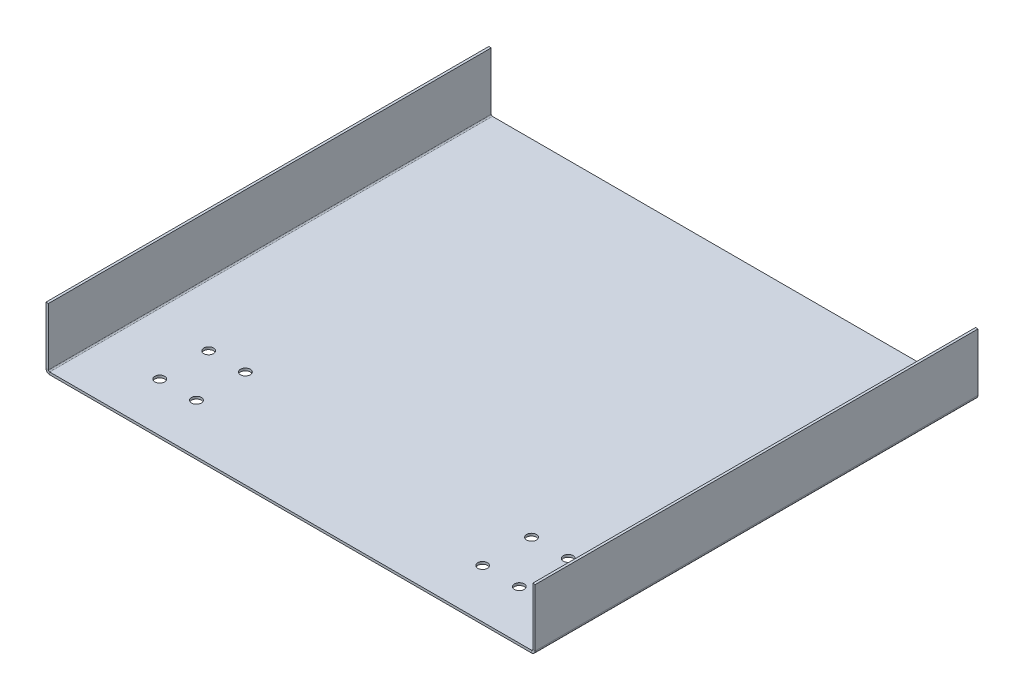
ISO-10303-21;
HEADER;
FILE_DESCRIPTION(('STEP AP214'),'2;1');
FILE_NAME('part.step','',(''),(''),'','','');
FILE_SCHEMA(('AUTOMOTIVE_DESIGN { 1 0 10303 214 1 1 1 1 }'));
ENDSEC;
DATA;
#1=APPLICATION_CONTEXT('core data for automotive mechanical design processes');
#2=APPLICATION_PROTOCOL_DEFINITION('international standard','automotive_design',2000,#1);
#3=PRODUCT_CONTEXT('',#1,'mechanical');
#4=PRODUCT('Part','Part','',(#3));
#5=PRODUCT_RELATED_PRODUCT_CATEGORY('part','',(#4));
#6=PRODUCT_DEFINITION_FORMATION('','',#4);
#7=PRODUCT_DEFINITION_CONTEXT('part definition',#1,'design');
#8=PRODUCT_DEFINITION('design','',#6,#7);
#9=PRODUCT_DEFINITION_SHAPE('','',#8);
#10=(LENGTH_UNIT() NAMED_UNIT(*) SI_UNIT(.MILLI.,.METRE.));
#11=(NAMED_UNIT(*) PLANE_ANGLE_UNIT() SI_UNIT($,.RADIAN.));
#12=(NAMED_UNIT(*) SI_UNIT($,.STERADIAN.) SOLID_ANGLE_UNIT());
#13=UNCERTAINTY_MEASURE_WITH_UNIT(LENGTH_MEASURE(1.E-05),#10,'distance_accuracy_value','');
#14=(GEOMETRIC_REPRESENTATION_CONTEXT(3) GLOBAL_UNCERTAINTY_ASSIGNED_CONTEXT((#13)) GLOBAL_UNIT_ASSIGNED_CONTEXT((#10,
#11,#12)) REPRESENTATION_CONTEXT('',''));
#15=CARTESIAN_POINT('',(0.,0.,0.));
#16=DIRECTION('',(0.,0.,1.));
#17=DIRECTION('',(1.,0.,0.));
#18=AXIS2_PLACEMENT_3D('',#15,#16,#17);
#19=CARTESIAN_POINT('',(0.,3.,362.));
#20=DIRECTION('',(0.,0.,1.));
#21=DIRECTION('',(1.,0.,0.));
#22=AXIS2_PLACEMENT_3D('',#19,#20,#21);
#23=PLANE('',#22);
#24=DIRECTION('',(1.,0.,0.));
#25=VECTOR('',#24,1.);
#26=CARTESIAN_POINT('',(0.,3.,362.));
#27=LINE('',#26,#25);
#28=CARTESIAN_POINT('',(0.,3.,362.));
#29=VERTEX_POINT('',#28);
#30=CARTESIAN_POINT('',(2.,3.,362.));
#31=VERTEX_POINT('',#30);
#32=EDGE_CURVE('E11',#29,#31,#27,.T.);
#33=ORIENTED_EDGE('',*,*,#32,.F.);
#34=CARTESIAN_POINT('',(3.,3.,362.));
#35=DIRECTION('',(0.,0.,-1.));
#36=DIRECTION('',(-1.,0.,0.));
#37=AXIS2_PLACEMENT_3D('',#34,#35,#36);
#38=CIRCLE('',#37,3.);
#39=CARTESIAN_POINT('',(3.,0.,362.));
#40=VERTEX_POINT('',#39);
#41=EDGE_CURVE('E294',#40,#29,#38,.T.);
#42=ORIENTED_EDGE('',*,*,#41,.F.);
#43=DIRECTION('',(0.,-1.,0.));
#44=VECTOR('',#43,1.);
#45=CARTESIAN_POINT('',(3.,2.,362.));
#46=LINE('',#45,#44);
#47=CARTESIAN_POINT('',(3.,2.,362.));
#48=VERTEX_POINT('',#47);
#49=EDGE_CURVE('E46',#48,#40,#46,.T.);
#50=ORIENTED_EDGE('',*,*,#49,.F.);
#51=CARTESIAN_POINT('',(3.,3.,362.));
#52=DIRECTION('',(0.,0.,1.));
#53=DIRECTION('',(1.,0.,0.));
#54=AXIS2_PLACEMENT_3D('',#51,#52,#53);
#55=CIRCLE('',#54,1.);
#56=EDGE_CURVE('E171',#48,#31,#55,.F.);
#57=ORIENTED_EDGE('',*,*,#56,.T.);
#58=EDGE_LOOP('',(#33,#42,#50,#57));
#59=FACE_BOUND('',#58,.T.);
#60=ADVANCED_FACE('F37',(#59),#23,.T.);
#61=CARTESIAN_POINT('',(3.,2.,362.));
#62=DIRECTION('',(0.,0.,1.));
#63=DIRECTION('',(1.,0.,0.));
#64=AXIS2_PLACEMENT_3D('',#61,#62,#63);
#65=PLANE('',#64);
#66=DIRECTION('',(0.,1.,0.));
#67=VECTOR('',#66,1.);
#68=CARTESIAN_POINT('',(0.,0.,362.));
#69=LINE('',#68,#67);
#70=CARTESIAN_POINT('',(0.,50.,362.));
#71=VERTEX_POINT('',#70);
#72=EDGE_CURVE('E291',#29,#71,#69,.T.);
#73=ORIENTED_EDGE('',*,*,#72,.F.);
#74=ORIENTED_EDGE('',*,*,#32,.T.);
#75=DIRECTION('',(0.,1.,0.));
#76=VECTOR('',#75,1.);
#77=CARTESIAN_POINT('',(2.,0.,362.));
#78=LINE('',#77,#76);
#79=CARTESIAN_POINT('',(2.,50.,362.));
#80=VERTEX_POINT('',#79);
#81=EDGE_CURVE('E107',#31,#80,#78,.T.);
#82=ORIENTED_EDGE('',*,*,#81,.T.);
#83=DIRECTION('',(1.,0.,0.));
#84=VECTOR('',#83,1.);
#85=CARTESIAN_POINT('',(0.,50.,362.));
#86=LINE('',#85,#84);
#87=EDGE_CURVE('E288',#71,#80,#86,.T.);
#88=ORIENTED_EDGE('',*,*,#87,.F.);
#89=EDGE_LOOP('',(#73,#74,#82,#88));
#90=FACE_BOUND('',#89,.T.);
#91=ADVANCED_FACE('F343',(#90),#65,.T.);
#92=CARTESIAN_POINT('',(3.,0.,0.));
#93=DIRECTION('',(0.,0.,-1.));
#94=DIRECTION('',(-1.,0.,0.));
#95=AXIS2_PLACEMENT_3D('',#92,#93,#94);
#96=PLANE('',#95);
#97=DIRECTION('',(0.,1.,0.));
#98=VECTOR('',#97,1.);
#99=CARTESIAN_POINT('',(3.,0.,0.));
#100=LINE('',#99,#98);
#101=CARTESIAN_POINT('',(3.,0.,0.));
#102=VERTEX_POINT('',#101);
#103=CARTESIAN_POINT('',(3.,2.,0.));
#104=VERTEX_POINT('',#103);
#105=EDGE_CURVE('E94',#102,#104,#100,.T.);
#106=ORIENTED_EDGE('',*,*,#105,.F.);
#107=CARTESIAN_POINT('',(3.,3.,0.));
#108=DIRECTION('',(0.,0.,-1.));
#109=DIRECTION('',(-1.,0.,0.));
#110=AXIS2_PLACEMENT_3D('',#107,#108,#109);
#111=CIRCLE('',#110,3.);
#112=CARTESIAN_POINT('',(0.,3.,0.));
#113=VERTEX_POINT('',#112);
#114=EDGE_CURVE('E187',#102,#113,#111,.T.);
#115=ORIENTED_EDGE('',*,*,#114,.T.);
#116=DIRECTION('',(-1.,0.,0.));
#117=VECTOR('',#116,1.);
#118=CARTESIAN_POINT('',(2.,3.,0.));
#119=LINE('',#118,#117);
#120=CARTESIAN_POINT('',(2.,3.,0.));
#121=VERTEX_POINT('',#120);
#122=EDGE_CURVE('E101',#121,#113,#119,.T.);
#123=ORIENTED_EDGE('',*,*,#122,.F.);
#124=CARTESIAN_POINT('',(3.,3.,0.));
#125=DIRECTION('',(0.,0.,1.));
#126=DIRECTION('',(1.,0.,0.));
#127=AXIS2_PLACEMENT_3D('',#124,#125,#126);
#128=CIRCLE('',#127,1.);
#129=EDGE_CURVE('E206',#104,#121,#128,.F.);
#130=ORIENTED_EDGE('',*,*,#129,.F.);
#131=EDGE_LOOP('',(#106,#115,#123,#130));
#132=FACE_BOUND('',#131,.T.);
#133=ADVANCED_FACE('F331',(#132),#96,.T.);
#134=CARTESIAN_POINT('',(2.,3.,0.));
#135=DIRECTION('',(0.,0.,-1.));
#136=DIRECTION('',(-1.,0.,0.));
#137=AXIS2_PLACEMENT_3D('',#134,#135,#136);
#138=PLANE('',#137);
#139=DIRECTION('',(-1.,0.,0.));
#140=VECTOR('',#139,1.);
#141=CARTESIAN_POINT('',(0.,0.,0.));
#142=LINE('',#141,#140);
#143=CARTESIAN_POINT('',(397.,0.,0.));
#144=VERTEX_POINT('',#143);
#145=EDGE_CURVE('E189',#144,#102,#142,.T.);
#146=ORIENTED_EDGE('',*,*,#145,.T.);
#147=ORIENTED_EDGE('',*,*,#105,.T.);
#148=DIRECTION('',(1.,0.,0.));
#149=VECTOR('',#148,1.);
#150=CARTESIAN_POINT('',(0.,2.,0.));
#151=LINE('',#150,#149);
#152=CARTESIAN_POINT('',(397.,2.,0.));
#153=VERTEX_POINT('',#152);
#154=EDGE_CURVE('E204',#153,#104,#151,.F.);
#155=ORIENTED_EDGE('',*,*,#154,.F.);
#156=DIRECTION('',(0.,-1.,0.));
#157=VECTOR('',#156,1.);
#158=CARTESIAN_POINT('',(397.,2.,0.));
#159=LINE('',#158,#157);
#160=EDGE_CURVE('E232',#153,#144,#159,.T.);
#161=ORIENTED_EDGE('',*,*,#160,.T.);
#162=EDGE_LOOP('',(#146,#147,#155,#161));
#163=FACE_BOUND('',#162,.T.);
#164=ADVANCED_FACE('F318',(#163),#138,.T.);
#165=CARTESIAN_POINT('',(397.,0.,362.));
#166=DIRECTION('',(0.,0.,1.));
#167=DIRECTION('',(1.,0.,0.));
#168=AXIS2_PLACEMENT_3D('',#165,#166,#167);
#169=PLANE('',#168);
#170=DIRECTION('',(0.,1.,0.));
#171=VECTOR('',#170,1.);
#172=CARTESIAN_POINT('',(397.,0.,362.));
#173=LINE('',#172,#171);
#174=CARTESIAN_POINT('',(397.,0.,362.));
#175=VERTEX_POINT('',#174);
#176=CARTESIAN_POINT('',(397.,2.,362.));
#177=VERTEX_POINT('',#176);
#178=EDGE_CURVE('E135',#175,#177,#173,.T.);
#179=ORIENTED_EDGE('',*,*,#178,.F.);
#180=CARTESIAN_POINT('',(397.,3.,362.));
#181=DIRECTION('',(0.,0.,-1.));
#182=DIRECTION('',(-1.,0.,0.));
#183=AXIS2_PLACEMENT_3D('',#180,#181,#182);
#184=CIRCLE('',#183,3.);
#185=CARTESIAN_POINT('',(400.,3.,362.));
#186=VERTEX_POINT('',#185);
#187=EDGE_CURVE('E298',#186,#175,#184,.T.);
#188=ORIENTED_EDGE('',*,*,#187,.F.);
#189=DIRECTION('',(1.,0.,0.));
#190=VECTOR('',#189,1.);
#191=CARTESIAN_POINT('',(398.,3.,362.));
#192=LINE('',#191,#190);
#193=CARTESIAN_POINT('',(398.,3.,362.));
#194=VERTEX_POINT('',#193);
#195=EDGE_CURVE('E147',#194,#186,#192,.T.);
#196=ORIENTED_EDGE('',*,*,#195,.F.);
#197=CARTESIAN_POINT('',(397.,3.,362.));
#198=DIRECTION('',(0.,0.,1.));
#199=DIRECTION('',(1.,0.,0.));
#200=AXIS2_PLACEMENT_3D('',#197,#198,#199);
#201=CIRCLE('',#200,1.);
#202=EDGE_CURVE('E150',#194,#177,#201,.F.);
#203=ORIENTED_EDGE('',*,*,#202,.T.);
#204=EDGE_LOOP('',(#179,#188,#196,#203));
#205=FACE_BOUND('',#204,.T.);
#206=ADVANCED_FACE('F152',(#205),#169,.T.);
#207=CARTESIAN_POINT('',(398.,3.,362.));
#208=DIRECTION('',(0.,0.,1.));
#209=DIRECTION('',(1.,0.,0.));
#210=AXIS2_PLACEMENT_3D('',#207,#208,#209);
#211=PLANE('',#210);
#212=DIRECTION('',(-1.,0.,0.));
#213=VECTOR('',#212,1.);
#214=CARTESIAN_POINT('',(0.,0.,362.));
#215=LINE('',#214,#213);
#216=EDGE_CURVE('E142',#175,#40,#215,.T.);
#217=ORIENTED_EDGE('',*,*,#216,.F.);
#218=ORIENTED_EDGE('',*,*,#178,.T.);
#219=DIRECTION('',(1.,0.,0.));
#220=VECTOR('',#219,1.);
#221=CARTESIAN_POINT('',(0.,2.,362.));
#222=LINE('',#221,#220);
#223=EDGE_CURVE('E139',#177,#48,#222,.F.);
#224=ORIENTED_EDGE('',*,*,#223,.T.);
#225=ORIENTED_EDGE('',*,*,#49,.T.);
#226=EDGE_LOOP('',(#217,#218,#224,#225));
#227=FACE_BOUND('',#226,.T.);
#228=ADVANCED_FACE('F137',(#227),#211,.T.);
#229=CARTESIAN_POINT('',(400.,3.,0.));
#230=DIRECTION('',(0.,0.,-1.));
#231=DIRECTION('',(-1.,0.,0.));
#232=AXIS2_PLACEMENT_3D('',#229,#230,#231);
#233=PLANE('',#232);
#234=DIRECTION('',(-1.,0.,0.));
#235=VECTOR('',#234,1.);
#236=CARTESIAN_POINT('',(400.,3.,0.));
#237=LINE('',#236,#235);
#238=CARTESIAN_POINT('',(400.,3.,0.));
#239=VERTEX_POINT('',#238);
#240=CARTESIAN_POINT('',(398.,3.,0.));
#241=VERTEX_POINT('',#240);
#242=EDGE_CURVE('E234',#239,#241,#237,.T.);
#243=ORIENTED_EDGE('',*,*,#242,.F.);
#244=CARTESIAN_POINT('',(397.,3.,0.));
#245=DIRECTION('',(0.,0.,-1.));
#246=DIRECTION('',(-1.,0.,0.));
#247=AXIS2_PLACEMENT_3D('',#244,#245,#246);
#248=CIRCLE('',#247,3.);
#249=EDGE_CURVE('E191',#239,#144,#248,.T.);
#250=ORIENTED_EDGE('',*,*,#249,.T.);
#251=ORIENTED_EDGE('',*,*,#160,.F.);
#252=CARTESIAN_POINT('',(397.,3.,0.));
#253=DIRECTION('',(0.,0.,1.));
#254=DIRECTION('',(1.,0.,0.));
#255=AXIS2_PLACEMENT_3D('',#252,#253,#254);
#256=CIRCLE('',#255,1.);
#257=EDGE_CURVE('E163',#241,#153,#256,.F.);
#258=ORIENTED_EDGE('',*,*,#257,.F.);
#259=EDGE_LOOP('',(#243,#250,#251,#258));
#260=FACE_BOUND('',#259,.T.);
#261=ADVANCED_FACE('F316',(#260),#233,.T.);
#262=CARTESIAN_POINT('',(397.,2.,0.));
#263=DIRECTION('',(0.,0.,-1.));
#264=DIRECTION('',(-1.,0.,0.));
#265=AXIS2_PLACEMENT_3D('',#262,#263,#264);
#266=PLANE('',#265);
#267=DIRECTION('',(0.,-1.,0.));
#268=VECTOR('',#267,1.);
#269=CARTESIAN_POINT('',(400.,50.,0.));
#270=LINE('',#269,#268);
#271=CARTESIAN_POINT('',(400.,50.,0.));
#272=VERTEX_POINT('',#271);
#273=EDGE_CURVE('E194',#272,#239,#270,.T.);
#274=ORIENTED_EDGE('',*,*,#273,.T.);
#275=ORIENTED_EDGE('',*,*,#242,.T.);
#276=DIRECTION('',(0.,1.,0.));
#277=VECTOR('',#276,1.);
#278=CARTESIAN_POINT('',(398.,50.,0.));
#279=LINE('',#278,#277);
#280=CARTESIAN_POINT('',(398.,50.,0.));
#281=VERTEX_POINT('',#280);
#282=EDGE_CURVE('E200',#281,#241,#279,.F.);
#283=ORIENTED_EDGE('',*,*,#282,.F.);
#284=DIRECTION('',(1.,0.,0.));
#285=VECTOR('',#284,1.);
#286=CARTESIAN_POINT('',(398.,50.,0.));
#287=LINE('',#286,#285);
#288=EDGE_CURVE('E197',#281,#272,#287,.T.);
#289=ORIENTED_EDGE('',*,*,#288,.T.);
#290=EDGE_LOOP('',(#274,#275,#283,#289));
#291=FACE_BOUND('',#290,.T.);
#292=ADVANCED_FACE('F372',(#291),#266,.T.);
#293=CARTESIAN_POINT('',(2.,0.,362.));
#294=DIRECTION('',(-1.,0.,0.));
#295=DIRECTION('',(0.,0.,1.));
#296=AXIS2_PLACEMENT_3D('',#293,#294,#295);
#297=PLANE('',#296);
#298=DIRECTION('',(0.,1.,0.));
#299=VECTOR('',#298,1.);
#300=CARTESIAN_POINT('',(2.,0.,0.));
#301=LINE('',#300,#299);
#302=CARTESIAN_POINT('',(2.,50.,0.));
#303=VERTEX_POINT('',#302);
#304=EDGE_CURVE('E177',#121,#303,#301,.T.);
#305=ORIENTED_EDGE('',*,*,#304,.T.);
#306=DIRECTION('',(0.,0.,-1.));
#307=VECTOR('',#306,1.);
#308=CARTESIAN_POINT('',(2.,50.,362.));
#309=LINE('',#308,#307);
#310=EDGE_CURVE('E230',#80,#303,#309,.T.);
#311=ORIENTED_EDGE('',*,*,#310,.F.);
#312=ORIENTED_EDGE('',*,*,#81,.F.);
#313=DIRECTION('',(0.,0.,-1.));
#314=VECTOR('',#313,1.);
#315=CARTESIAN_POINT('',(2.,3.,362.));
#316=LINE('',#315,#314);
#317=EDGE_CURVE('E173',#31,#121,#316,.T.);
#318=ORIENTED_EDGE('',*,*,#317,.T.);
#319=EDGE_LOOP('',(#305,#311,#312,#318));
#320=FACE_BOUND('',#319,.T.);
#321=ADVANCED_FACE('F337',(#320),#297,.F.);
#322=CARTESIAN_POINT('',(0.,50.,362.));
#323=DIRECTION('',(0.,1.,0.));
#324=DIRECTION('',(0.,0.,1.));
#325=AXIS2_PLACEMENT_3D('',#322,#323,#324);
#326=PLANE('',#325);
#327=DIRECTION('',(1.,0.,0.));
#328=VECTOR('',#327,1.);
#329=CARTESIAN_POINT('',(0.,50.,0.));
#330=LINE('',#329,#328);
#331=CARTESIAN_POINT('',(0.,50.,0.));
#332=VERTEX_POINT('',#331);
#333=EDGE_CURVE('E180',#332,#303,#330,.T.);
#334=ORIENTED_EDGE('',*,*,#333,.F.);
#335=DIRECTION('',(0.,0.,-1.));
#336=VECTOR('',#335,1.);
#337=CARTESIAN_POINT('',(0.,50.,362.));
#338=LINE('',#337,#336);
#339=EDGE_CURVE('E228',#71,#332,#338,.T.);
#340=ORIENTED_EDGE('',*,*,#339,.F.);
#341=ORIENTED_EDGE('',*,*,#87,.T.);
#342=ORIENTED_EDGE('',*,*,#310,.T.);
#343=EDGE_LOOP('',(#334,#340,#341,#342));
#344=FACE_BOUND('',#343,.T.);
#345=ADVANCED_FACE('F342',(#344),#326,.T.);
#346=CARTESIAN_POINT('',(0.,0.,362.));
#347=DIRECTION('',(-1.,0.,0.));
#348=DIRECTION('',(0.,0.,1.));
#349=AXIS2_PLACEMENT_3D('',#346,#347,#348);
#350=PLANE('',#349);
#351=DIRECTION('',(0.,1.,0.));
#352=VECTOR('',#351,1.);
#353=CARTESIAN_POINT('',(0.,0.,0.));
#354=LINE('',#353,#352);
#355=EDGE_CURVE('E184',#113,#332,#354,.T.);
#356=ORIENTED_EDGE('',*,*,#355,.F.);
#357=DIRECTION('',(0.,0.,-1.));
#358=VECTOR('',#357,1.);
#359=CARTESIAN_POINT('',(0.,3.,362.));
#360=LINE('',#359,#358);
#361=EDGE_CURVE('E225',#29,#113,#360,.T.);
#362=ORIENTED_EDGE('',*,*,#361,.F.);
#363=ORIENTED_EDGE('',*,*,#72,.T.);
#364=ORIENTED_EDGE('',*,*,#339,.T.);
#365=EDGE_LOOP('',(#356,#362,#363,#364));
#366=FACE_BOUND('',#365,.T.);
#367=ADVANCED_FACE('F345',(#366),#350,.T.);
#368=CARTESIAN_POINT('',(3.,3.,362.));
#369=DIRECTION('',(0.,0.,-1.));
#370=DIRECTION('',(-1.,0.,0.));
#371=AXIS2_PLACEMENT_3D('',#368,#369,#370);
#372=CYLINDRICAL_SURFACE('',#371,3.);
#373=ORIENTED_EDGE('',*,*,#114,.F.);
#374=DIRECTION('',(0.,0.,-1.));
#375=VECTOR('',#374,1.);
#376=CARTESIAN_POINT('',(3.,0.,362.));
#377=LINE('',#376,#375);
#378=EDGE_CURVE('E222',#40,#102,#377,.T.);
#379=ORIENTED_EDGE('',*,*,#378,.F.);
#380=ORIENTED_EDGE('',*,*,#41,.T.);
#381=ORIENTED_EDGE('',*,*,#361,.T.);
#382=EDGE_LOOP('',(#373,#379,#380,#381));
#383=FACE_BOUND('',#382,.T.);
#384=ADVANCED_FACE('F328',(#383),#372,.T.);
#385=CARTESIAN_POINT('',(0.,0.,362.));
#386=DIRECTION('',(0.,-1.,0.));
#387=DIRECTION('',(0.,0.,-1.));
#388=AXIS2_PLACEMENT_3D('',#385,#386,#387);
#389=PLANE('',#388);
#390=CARTESIAN_POINT('',(347.,0.,322.));
#391=DIRECTION('',(0.,-1.,0.));
#392=DIRECTION('',(0.,0.,1.));
#393=AXIS2_PLACEMENT_3D('',#390,#391,#392);
#394=CIRCLE('',#393,4.00000000000005);
#395=CARTESIAN_POINT('',(347.,0.,326.));
#396=VERTEX_POINT('',#395);
#397=EDGE_CURVE('E274',#396,#396,#394,.T.);
#398=ORIENTED_EDGE('',*,*,#397,.F.);
#399=EDGE_LOOP('',(#398));
#400=FACE_BOUND('',#399,.T.);
#401=CARTESIAN_POINT('',(317.,0.,322.));
#402=DIRECTION('',(0.,-1.,0.));
#403=DIRECTION('',(0.,0.,-1.));
#404=AXIS2_PLACEMENT_3D('',#401,#402,#403);
#405=CIRCLE('',#404,3.99999999999999);
#406=CARTESIAN_POINT('',(317.,0.,318.));
#407=VERTEX_POINT('',#406);
#408=EDGE_CURVE('E264',#407,#407,#405,.T.);
#409=ORIENTED_EDGE('',*,*,#408,.F.);
#410=EDGE_LOOP('',(#409));
#411=FACE_BOUND('',#410,.T.);
#412=CARTESIAN_POINT('',(317.,0.,282.));
#413=DIRECTION('',(0.,-1.,0.));
#414=DIRECTION('',(0.,0.,1.));
#415=AXIS2_PLACEMENT_3D('',#412,#413,#414);
#416=CIRCLE('',#415,3.99999999999999);
#417=CARTESIAN_POINT('',(317.,0.,286.));
#418=VERTEX_POINT('',#417);
#419=EDGE_CURVE('E261',#418,#418,#416,.T.);
#420=ORIENTED_EDGE('',*,*,#419,.F.);
#421=EDGE_LOOP('',(#420));
#422=FACE_BOUND('',#421,.T.);
#423=CARTESIAN_POINT('',(347.,0.,282.));
#424=DIRECTION('',(0.,-1.,0.));
#425=DIRECTION('',(0.,0.,-1.));
#426=AXIS2_PLACEMENT_3D('',#423,#424,#425);
#427=CIRCLE('',#426,4.00000000000005);
#428=CARTESIAN_POINT('',(347.,0.,278.));
#429=VERTEX_POINT('',#428);
#430=EDGE_CURVE('E258',#429,#429,#427,.T.);
#431=ORIENTED_EDGE('',*,*,#430,.F.);
#432=EDGE_LOOP('',(#431));
#433=FACE_BOUND('',#432,.T.);
#434=CARTESIAN_POINT('',(53.,0.,282.));
#435=DIRECTION('',(0.,-1.,0.));
#436=DIRECTION('',(0.,0.,1.));
#437=AXIS2_PLACEMENT_3D('',#434,#435,#436);
#438=CIRCLE('',#437,4.00000000000001);
#439=CARTESIAN_POINT('',(53.,0.,286.));
#440=VERTEX_POINT('',#439);
#441=EDGE_CURVE('E254',#440,#440,#438,.T.);
#442=ORIENTED_EDGE('',*,*,#441,.F.);
#443=EDGE_LOOP('',(#442));
#444=FACE_BOUND('',#443,.T.);
#445=CARTESIAN_POINT('',(82.9999999999999,0.,282.));
#446=DIRECTION('',(0.,-1.,0.));
#447=DIRECTION('',(0.,0.,-1.));
#448=AXIS2_PLACEMENT_3D('',#445,#446,#447);
#449=CIRCLE('',#448,4.00000000000001);
#450=CARTESIAN_POINT('',(82.9999999999999,0.,278.));
#451=VERTEX_POINT('',#450);
#452=EDGE_CURVE('E250',#451,#451,#449,.T.);
#453=ORIENTED_EDGE('',*,*,#452,.F.);
#454=EDGE_LOOP('',(#453));
#455=FACE_BOUND('',#454,.T.);
#456=CARTESIAN_POINT('',(82.9999999999999,0.,322.));
#457=DIRECTION('',(0.,-1.,0.));
#458=DIRECTION('',(0.,0.,1.));
#459=AXIS2_PLACEMENT_3D('',#456,#457,#458);
#460=CIRCLE('',#459,4.00000000000001);
#461=CARTESIAN_POINT('',(82.9999999999999,0.,326.));
#462=VERTEX_POINT('',#461);
#463=EDGE_CURVE('E246',#462,#462,#460,.T.);
#464=ORIENTED_EDGE('',*,*,#463,.F.);
#465=EDGE_LOOP('',(#464));
#466=FACE_BOUND('',#465,.T.);
#467=CARTESIAN_POINT('',(53.,0.,322.));
#468=DIRECTION('',(0.,-1.,0.));
#469=DIRECTION('',(0.,0.,-1.));
#470=AXIS2_PLACEMENT_3D('',#467,#468,#469);
#471=CIRCLE('',#470,4.00000000000001);
#472=CARTESIAN_POINT('',(53.,0.,318.));
#473=VERTEX_POINT('',#472);
#474=EDGE_CURVE('E242',#473,#473,#471,.T.);
#475=ORIENTED_EDGE('',*,*,#474,.F.);
#476=EDGE_LOOP('',(#475));
#477=FACE_BOUND('',#476,.T.);
#478=ORIENTED_EDGE('',*,*,#145,.F.);
#479=DIRECTION('',(0.,0.,-1.));
#480=VECTOR('',#479,1.);
#481=CARTESIAN_POINT('',(397.,0.,362.));
#482=LINE('',#481,#480);
#483=EDGE_CURVE('E219',#175,#144,#482,.T.);
#484=ORIENTED_EDGE('',*,*,#483,.F.);
#485=ORIENTED_EDGE('',*,*,#216,.T.);
#486=ORIENTED_EDGE('',*,*,#378,.T.);
#487=EDGE_LOOP('',(#478,#484,#485,#486));
#488=FACE_BOUND('',#487,.T.);
#489=ADVANCED_FACE('F323',(#400,#411,#422,#433,#444,#455,#466,#477,#488),#389,.T.);
#490=CARTESIAN_POINT('',(397.,3.,362.));
#491=DIRECTION('',(0.,0.,-1.));
#492=DIRECTION('',(-1.,0.,0.));
#493=AXIS2_PLACEMENT_3D('',#490,#491,#492);
#494=CYLINDRICAL_SURFACE('',#493,3.);
#495=ORIENTED_EDGE('',*,*,#249,.F.);
#496=DIRECTION('',(0.,0.,-1.));
#497=VECTOR('',#496,1.);
#498=CARTESIAN_POINT('',(400.,3.,362.));
#499=LINE('',#498,#497);
#500=EDGE_CURVE('E216',#186,#239,#499,.T.);
#501=ORIENTED_EDGE('',*,*,#500,.F.);
#502=ORIENTED_EDGE('',*,*,#187,.T.);
#503=ORIENTED_EDGE('',*,*,#483,.T.);
#504=EDGE_LOOP('',(#495,#501,#502,#503));
#505=FACE_BOUND('',#504,.T.);
#506=ADVANCED_FACE('F321',(#505),#494,.T.);
#507=CARTESIAN_POINT('',(400.,50.,362.));
#508=DIRECTION('',(1.,0.,0.));
#509=DIRECTION('',(0.,0.,-1.));
#510=AXIS2_PLACEMENT_3D('',#507,#508,#509);
#511=PLANE('',#510);
#512=ORIENTED_EDGE('',*,*,#273,.F.);
#513=DIRECTION('',(0.,0.,-1.));
#514=VECTOR('',#513,1.);
#515=CARTESIAN_POINT('',(400.,50.,362.));
#516=LINE('',#515,#514);
#517=CARTESIAN_POINT('',(400.,50.,362.));
#518=VERTEX_POINT('',#517);
#519=EDGE_CURVE('E214',#518,#272,#516,.T.);
#520=ORIENTED_EDGE('',*,*,#519,.F.);
#521=DIRECTION('',(0.,-1.,0.));
#522=VECTOR('',#521,1.);
#523=CARTESIAN_POINT('',(400.,50.,362.));
#524=LINE('',#523,#522);
#525=EDGE_CURVE('E300',#518,#186,#524,.T.);
#526=ORIENTED_EDGE('',*,*,#525,.T.);
#527=ORIENTED_EDGE('',*,*,#500,.T.);
#528=EDGE_LOOP('',(#512,#520,#526,#527));
#529=FACE_BOUND('',#528,.T.);
#530=ADVANCED_FACE('F409',(#529),#511,.T.);
#531=CARTESIAN_POINT('',(398.,50.,362.));
#532=DIRECTION('',(0.,1.,0.));
#533=DIRECTION('',(0.,0.,1.));
#534=AXIS2_PLACEMENT_3D('',#531,#532,#533);
#535=PLANE('',#534);
#536=ORIENTED_EDGE('',*,*,#288,.F.);
#537=DIRECTION('',(0.,0.,-1.));
#538=VECTOR('',#537,1.);
#539=CARTESIAN_POINT('',(398.,50.,362.));
#540=LINE('',#539,#538);
#541=CARTESIAN_POINT('',(398.,50.,362.));
#542=VERTEX_POINT('',#541);
#543=EDGE_CURVE('E212',#542,#281,#540,.T.);
#544=ORIENTED_EDGE('',*,*,#543,.F.);
#545=DIRECTION('',(1.,0.,0.));
#546=VECTOR('',#545,1.);
#547=CARTESIAN_POINT('',(398.,50.,362.));
#548=LINE('',#547,#546);
#549=EDGE_CURVE('E303',#542,#518,#548,.T.);
#550=ORIENTED_EDGE('',*,*,#549,.T.);
#551=ORIENTED_EDGE('',*,*,#519,.T.);
#552=EDGE_LOOP('',(#536,#544,#550,#551));
#553=FACE_BOUND('',#552,.T.);
#554=ADVANCED_FACE('F419',(#553),#535,.T.);
#555=CARTESIAN_POINT('',(398.,50.,362.));
#556=DIRECTION('',(1.,0.,0.));
#557=DIRECTION('',(0.,0.,-1.));
#558=AXIS2_PLACEMENT_3D('',#555,#556,#557);
#559=PLANE('',#558);
#560=ORIENTED_EDGE('',*,*,#282,.T.);
#561=DIRECTION('',(0.,0.,-1.));
#562=VECTOR('',#561,1.);
#563=CARTESIAN_POINT('',(398.,3.,362.));
#564=LINE('',#563,#562);
#565=EDGE_CURVE('E165',#194,#241,#564,.T.);
#566=ORIENTED_EDGE('',*,*,#565,.F.);
#567=DIRECTION('',(0.,1.,0.));
#568=VECTOR('',#567,1.);
#569=CARTESIAN_POINT('',(398.,50.,362.));
#570=LINE('',#569,#568);
#571=EDGE_CURVE('E156',#542,#194,#570,.F.);
#572=ORIENTED_EDGE('',*,*,#571,.F.);
#573=ORIENTED_EDGE('',*,*,#543,.T.);
#574=EDGE_LOOP('',(#560,#566,#572,#573));
#575=FACE_BOUND('',#574,.T.);
#576=ADVANCED_FACE('F313',(#575),#559,.F.);
#577=CARTESIAN_POINT('',(397.,3.,362.));
#578=DIRECTION('',(0.,0.,-1.));
#579=DIRECTION('',(-1.,0.,0.));
#580=AXIS2_PLACEMENT_3D('',#577,#578,#579);
#581=CYLINDRICAL_SURFACE('',#580,1.);
#582=ORIENTED_EDGE('',*,*,#257,.T.);
#583=DIRECTION('',(0.,0.,-1.));
#584=VECTOR('',#583,1.);
#585=CARTESIAN_POINT('',(397.,2.,362.));
#586=LINE('',#585,#584);
#587=EDGE_CURVE('E160',#177,#153,#586,.T.);
#588=ORIENTED_EDGE('',*,*,#587,.F.);
#589=ORIENTED_EDGE('',*,*,#202,.F.);
#590=ORIENTED_EDGE('',*,*,#565,.T.);
#591=EDGE_LOOP('',(#582,#588,#589,#590));
#592=FACE_BOUND('',#591,.T.);
#593=ADVANCED_FACE('F161',(#592),#581,.F.);
#594=CARTESIAN_POINT('',(0.,2.,362.));
#595=DIRECTION('',(0.,-1.,0.));
#596=DIRECTION('',(0.,0.,-1.));
#597=AXIS2_PLACEMENT_3D('',#594,#595,#596);
#598=PLANE('',#597);
#599=CARTESIAN_POINT('',(347.,2.,322.));
#600=DIRECTION('',(0.,-1.,0.));
#601=DIRECTION('',(0.,0.,-1.));
#602=AXIS2_PLACEMENT_3D('',#599,#600,#601);
#603=CIRCLE('',#602,4.00000000000005);
#604=CARTESIAN_POINT('',(347.,2.,318.));
#605=VERTEX_POINT('',#604);
#606=EDGE_CURVE('E40',#605,#605,#603,.T.);
#607=ORIENTED_EDGE('',*,*,#606,.T.);
#608=EDGE_LOOP('',(#607));
#609=FACE_BOUND('',#608,.T.);
#610=CARTESIAN_POINT('',(317.,2.,322.));
#611=DIRECTION('',(0.,-1.,0.));
#612=DIRECTION('',(0.,0.,-1.));
#613=AXIS2_PLACEMENT_3D('',#610,#611,#612);
#614=CIRCLE('',#613,3.99999999999999);
#615=CARTESIAN_POINT('',(317.,2.,318.));
#616=VERTEX_POINT('',#615);
#617=EDGE_CURVE('E262',#616,#616,#614,.T.);
#618=ORIENTED_EDGE('',*,*,#617,.T.);
#619=EDGE_LOOP('',(#618));
#620=FACE_BOUND('',#619,.T.);
#621=CARTESIAN_POINT('',(317.,2.,282.));
#622=DIRECTION('',(0.,-1.,0.));
#623=DIRECTION('',(0.,0.,-1.));
#624=AXIS2_PLACEMENT_3D('',#621,#622,#623);
#625=CIRCLE('',#624,3.99999999999999);
#626=CARTESIAN_POINT('',(317.,2.,278.));
#627=VERTEX_POINT('',#626);
#628=EDGE_CURVE('E259',#627,#627,#625,.T.);
#629=ORIENTED_EDGE('',*,*,#628,.T.);
#630=EDGE_LOOP('',(#629));
#631=FACE_BOUND('',#630,.T.);
#632=CARTESIAN_POINT('',(347.,2.,282.));
#633=DIRECTION('',(0.,-1.,0.));
#634=DIRECTION('',(0.,0.,-1.));
#635=AXIS2_PLACEMENT_3D('',#632,#633,#634);
#636=CIRCLE('',#635,4.00000000000005);
#637=CARTESIAN_POINT('',(347.,2.,278.));
#638=VERTEX_POINT('',#637);
#639=EDGE_CURVE('E255',#638,#638,#636,.T.);
#640=ORIENTED_EDGE('',*,*,#639,.T.);
#641=EDGE_LOOP('',(#640));
#642=FACE_BOUND('',#641,.T.);
#643=CARTESIAN_POINT('',(53.,2.,282.));
#644=DIRECTION('',(0.,-1.,0.));
#645=DIRECTION('',(0.,0.,-1.));
#646=AXIS2_PLACEMENT_3D('',#643,#644,#645);
#647=CIRCLE('',#646,4.00000000000001);
#648=CARTESIAN_POINT('',(53.,2.,278.));
#649=VERTEX_POINT('',#648);
#650=EDGE_CURVE('E251',#649,#649,#647,.T.);
#651=ORIENTED_EDGE('',*,*,#650,.T.);
#652=EDGE_LOOP('',(#651));
#653=FACE_BOUND('',#652,.T.);
#654=CARTESIAN_POINT('',(82.9999999999999,2.,282.));
#655=DIRECTION('',(0.,-1.,0.));
#656=DIRECTION('',(0.,0.,-1.));
#657=AXIS2_PLACEMENT_3D('',#654,#655,#656);
#658=CIRCLE('',#657,4.00000000000001);
#659=CARTESIAN_POINT('',(82.9999999999999,2.,278.));
#660=VERTEX_POINT('',#659);
#661=EDGE_CURVE('E247',#660,#660,#658,.T.);
#662=ORIENTED_EDGE('',*,*,#661,.T.);
#663=EDGE_LOOP('',(#662));
#664=FACE_BOUND('',#663,.T.);
#665=CARTESIAN_POINT('',(82.9999999999999,2.,322.));
#666=DIRECTION('',(0.,-1.,0.));
#667=DIRECTION('',(0.,0.,-1.));
#668=AXIS2_PLACEMENT_3D('',#665,#666,#667);
#669=CIRCLE('',#668,4.00000000000001);
#670=CARTESIAN_POINT('',(82.9999999999999,2.,318.));
#671=VERTEX_POINT('',#670);
#672=EDGE_CURVE('E243',#671,#671,#669,.T.);
#673=ORIENTED_EDGE('',*,*,#672,.T.);
#674=EDGE_LOOP('',(#673));
#675=FACE_BOUND('',#674,.T.);
#676=CARTESIAN_POINT('',(53.,2.,322.));
#677=DIRECTION('',(0.,-1.,0.));
#678=DIRECTION('',(0.,0.,-1.));
#679=AXIS2_PLACEMENT_3D('',#676,#677,#678);
#680=CIRCLE('',#679,4.00000000000001);
#681=CARTESIAN_POINT('',(53.,2.,318.));
#682=VERTEX_POINT('',#681);
#683=EDGE_CURVE('E181',#682,#682,#680,.T.);
#684=ORIENTED_EDGE('',*,*,#683,.T.);
#685=EDGE_LOOP('',(#684));
#686=FACE_BOUND('',#685,.T.);
#687=ORIENTED_EDGE('',*,*,#154,.T.);
#688=DIRECTION('',(0.,0.,-1.));
#689=VECTOR('',#688,1.);
#690=CARTESIAN_POINT('',(3.,2.,362.));
#691=LINE('',#690,#689);
#692=EDGE_CURVE('E166',#48,#104,#691,.T.);
#693=ORIENTED_EDGE('',*,*,#692,.F.);
#694=ORIENTED_EDGE('',*,*,#223,.F.);
#695=ORIENTED_EDGE('',*,*,#587,.T.);
#696=EDGE_LOOP('',(#687,#693,#694,#695));
#697=FACE_BOUND('',#696,.T.);
#698=ADVANCED_FACE('F168',(#609,#620,#631,#642,#653,#664,#675,#686,#697),#598,.F.);
#699=CARTESIAN_POINT('',(3.,3.,362.));
#700=DIRECTION('',(0.,0.,-1.));
#701=DIRECTION('',(-1.,0.,0.));
#702=AXIS2_PLACEMENT_3D('',#699,#700,#701);
#703=CYLINDRICAL_SURFACE('',#702,1.);
#704=ORIENTED_EDGE('',*,*,#129,.T.);
#705=ORIENTED_EDGE('',*,*,#317,.F.);
#706=ORIENTED_EDGE('',*,*,#56,.F.);
#707=ORIENTED_EDGE('',*,*,#692,.T.);
#708=EDGE_LOOP('',(#704,#705,#706,#707));
#709=FACE_BOUND('',#708,.T.);
#710=ADVANCED_FACE('F334',(#709),#703,.F.);
#711=CARTESIAN_POINT('',(3.,3.,362.));
#712=DIRECTION('',(0.,0.,-1.));
#713=DIRECTION('',(-1.,0.,0.));
#714=AXIS2_PLACEMENT_3D('',#711,#712,#713);
#715=PLANE('',#714);
#716=ORIENTED_EDGE('',*,*,#571,.T.);
#717=ORIENTED_EDGE('',*,*,#195,.T.);
#718=ORIENTED_EDGE('',*,*,#525,.F.);
#719=ORIENTED_EDGE('',*,*,#549,.F.);
#720=EDGE_LOOP('',(#716,#717,#718,#719));
#721=FACE_BOUND('',#720,.T.);
#722=ADVANCED_FACE('F309',(#721),#715,.F.);
#723=CARTESIAN_POINT('',(3.,3.,0.));
#724=DIRECTION('',(0.,0.,-1.));
#725=DIRECTION('',(-1.,0.,0.));
#726=AXIS2_PLACEMENT_3D('',#723,#724,#725);
#727=PLANE('',#726);
#728=ORIENTED_EDGE('',*,*,#304,.F.);
#729=ORIENTED_EDGE('',*,*,#122,.T.);
#730=ORIENTED_EDGE('',*,*,#355,.T.);
#731=ORIENTED_EDGE('',*,*,#333,.T.);
#732=EDGE_LOOP('',(#728,#729,#730,#731));
#733=FACE_BOUND('',#732,.T.);
#734=ADVANCED_FACE('F339',(#733),#727,.T.);
#735=CARTESIAN_POINT('',(53.,10.,322.));
#736=DIRECTION('',(0.,-1.,0.));
#737=DIRECTION('',(0.,0.,-1.));
#738=AXIS2_PLACEMENT_3D('',#735,#736,#737);
#739=CYLINDRICAL_SURFACE('',#738,4.00000000000001);
#740=ORIENTED_EDGE('',*,*,#474,.T.);
#741=EDGE_LOOP('',(#740));
#742=FACE_BOUND('',#741,.T.);
#743=ORIENTED_EDGE('',*,*,#683,.F.);
#744=EDGE_LOOP('',(#743));
#745=FACE_BOUND('',#744,.T.);
#746=ADVANCED_FACE('F478',(#742,#745),#739,.F.);
#747=CARTESIAN_POINT('',(82.9999999999999,10.,322.));
#748=DIRECTION('',(0.,-1.,0.));
#749=DIRECTION('',(0.,0.,-1.));
#750=AXIS2_PLACEMENT_3D('',#747,#748,#749);
#751=CYLINDRICAL_SURFACE('',#750,4.00000000000001);
#752=ORIENTED_EDGE('',*,*,#463,.T.);
#753=EDGE_LOOP('',(#752));
#754=FACE_BOUND('',#753,.T.);
#755=ORIENTED_EDGE('',*,*,#672,.F.);
#756=EDGE_LOOP('',(#755));
#757=FACE_BOUND('',#756,.T.);
#758=ADVANCED_FACE('F504',(#754,#757),#751,.F.);
#759=CARTESIAN_POINT('',(82.9999999999999,10.,282.));
#760=DIRECTION('',(0.,-1.,0.));
#761=DIRECTION('',(0.,0.,-1.));
#762=AXIS2_PLACEMENT_3D('',#759,#760,#761);
#763=CYLINDRICAL_SURFACE('',#762,4.00000000000001);
#764=ORIENTED_EDGE('',*,*,#452,.T.);
#765=EDGE_LOOP('',(#764));
#766=FACE_BOUND('',#765,.T.);
#767=ORIENTED_EDGE('',*,*,#661,.F.);
#768=EDGE_LOOP('',(#767));
#769=FACE_BOUND('',#768,.T.);
#770=ADVANCED_FACE('F515',(#766,#769),#763,.F.);
#771=CARTESIAN_POINT('',(53.,10.,282.));
#772=DIRECTION('',(0.,-1.,0.));
#773=DIRECTION('',(0.,0.,-1.));
#774=AXIS2_PLACEMENT_3D('',#771,#772,#773);
#775=CYLINDRICAL_SURFACE('',#774,4.00000000000001);
#776=ORIENTED_EDGE('',*,*,#441,.T.);
#777=EDGE_LOOP('',(#776));
#778=FACE_BOUND('',#777,.T.);
#779=ORIENTED_EDGE('',*,*,#650,.F.);
#780=EDGE_LOOP('',(#779));
#781=FACE_BOUND('',#780,.T.);
#782=ADVANCED_FACE('F526',(#778,#781),#775,.F.);
#783=CARTESIAN_POINT('',(347.,10.,282.));
#784=DIRECTION('',(0.,-1.,0.));
#785=DIRECTION('',(0.,0.,-1.));
#786=AXIS2_PLACEMENT_3D('',#783,#784,#785);
#787=CYLINDRICAL_SURFACE('',#786,4.00000000000005);
#788=ORIENTED_EDGE('',*,*,#430,.T.);
#789=EDGE_LOOP('',(#788));
#790=FACE_BOUND('',#789,.T.);
#791=ORIENTED_EDGE('',*,*,#639,.F.);
#792=EDGE_LOOP('',(#791));
#793=FACE_BOUND('',#792,.T.);
#794=ADVANCED_FACE('F537',(#790,#793),#787,.F.);
#795=CARTESIAN_POINT('',(317.,10.,282.));
#796=DIRECTION('',(0.,-1.,0.));
#797=DIRECTION('',(0.,0.,-1.));
#798=AXIS2_PLACEMENT_3D('',#795,#796,#797);
#799=CYLINDRICAL_SURFACE('',#798,3.99999999999999);
#800=ORIENTED_EDGE('',*,*,#419,.T.);
#801=EDGE_LOOP('',(#800));
#802=FACE_BOUND('',#801,.T.);
#803=ORIENTED_EDGE('',*,*,#628,.F.);
#804=EDGE_LOOP('',(#803));
#805=FACE_BOUND('',#804,.T.);
#806=ADVANCED_FACE('F548',(#802,#805),#799,.F.);
#807=CARTESIAN_POINT('',(317.,10.,322.));
#808=DIRECTION('',(0.,-1.,0.));
#809=DIRECTION('',(0.,0.,-1.));
#810=AXIS2_PLACEMENT_3D('',#807,#808,#809);
#811=CYLINDRICAL_SURFACE('',#810,3.99999999999999);
#812=ORIENTED_EDGE('',*,*,#408,.T.);
#813=EDGE_LOOP('',(#812));
#814=FACE_BOUND('',#813,.T.);
#815=ORIENTED_EDGE('',*,*,#617,.F.);
#816=EDGE_LOOP('',(#815));
#817=FACE_BOUND('',#816,.T.);
#818=ADVANCED_FACE('F559',(#814,#817),#811,.F.);
#819=CARTESIAN_POINT('',(347.,10.,322.));
#820=DIRECTION('',(0.,-1.,0.));
#821=DIRECTION('',(0.,0.,-1.));
#822=AXIS2_PLACEMENT_3D('',#819,#820,#821);
#823=CYLINDRICAL_SURFACE('',#822,4.00000000000005);
#824=ORIENTED_EDGE('',*,*,#397,.T.);
#825=EDGE_LOOP('',(#824));
#826=FACE_BOUND('',#825,.T.);
#827=ORIENTED_EDGE('',*,*,#606,.F.);
#828=EDGE_LOOP('',(#827));
#829=FACE_BOUND('',#828,.T.);
#830=ADVANCED_FACE('F570',(#826,#829),#823,.F.);
#831=CLOSED_SHELL('',(#60,#91,#133,#164,#206,#228,#261,#292,#321,#345,#367,#384,#489,#506,#530,
#554,#576,#593,#698,#710,#722,#734,#746,#758,#770,#782,#794,#806,#818,#830));
#832=MANIFOLD_SOLID_BREP('B2',#831);
#833=ADVANCED_BREP_SHAPE_REPRESENTATION('',(#18,#832),#14);
#834=SHAPE_DEFINITION_REPRESENTATION(#9,#833);
ENDSEC;
END-ISO-10303-21;
